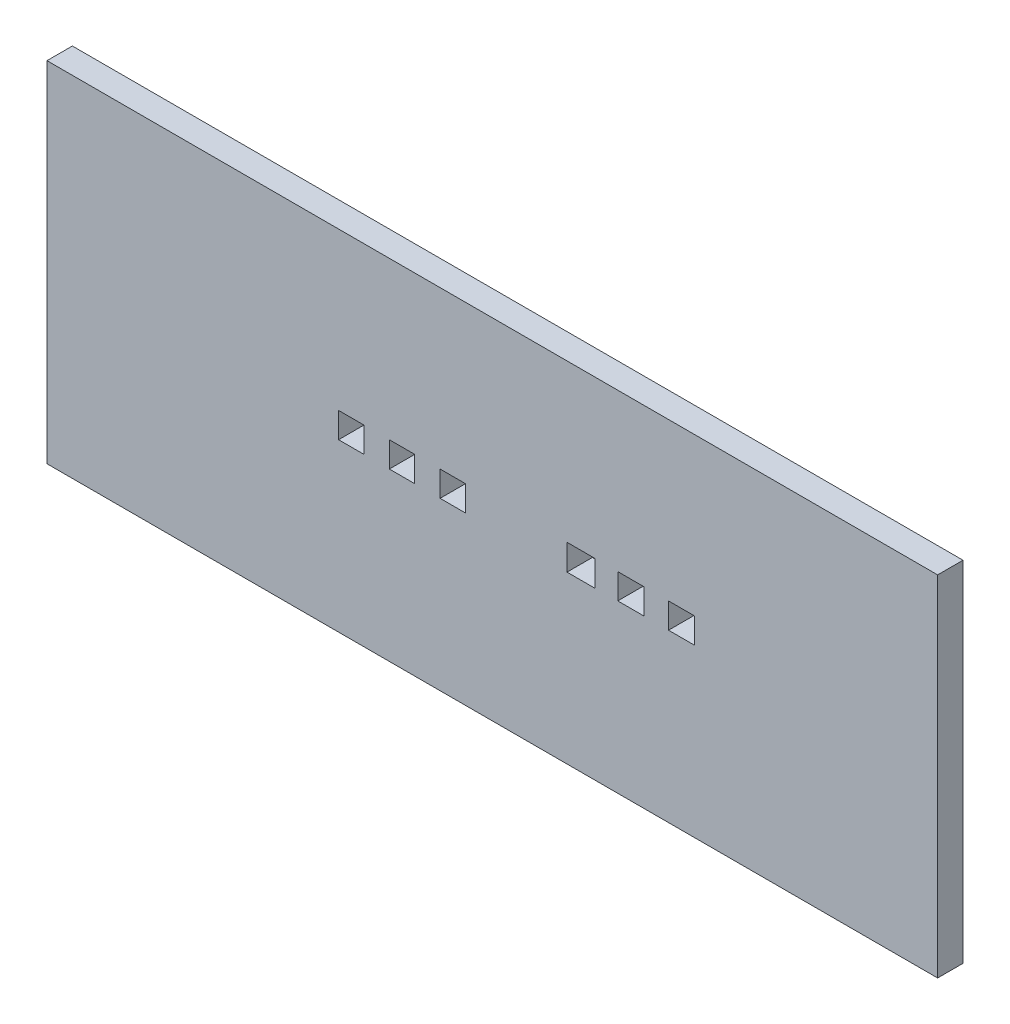
ISO-10303-21;
HEADER;
FILE_DESCRIPTION(('STEP AP214'),'2;1');
FILE_NAME('part.step','',(''),(''),'','','');
FILE_SCHEMA(('AUTOMOTIVE_DESIGN { 1 0 10303 214 1 1 1 1 }'));
ENDSEC;
DATA;
#1=APPLICATION_CONTEXT('core data for automotive mechanical design processes');
#2=APPLICATION_PROTOCOL_DEFINITION('international standard','automotive_design',2000,#1);
#3=PRODUCT_CONTEXT('',#1,'mechanical');
#4=PRODUCT('Part','Part','',(#3));
#5=PRODUCT_RELATED_PRODUCT_CATEGORY('part','',(#4));
#6=PRODUCT_DEFINITION_FORMATION('','',#4);
#7=PRODUCT_DEFINITION_CONTEXT('part definition',#1,'design');
#8=PRODUCT_DEFINITION('design','',#6,#7);
#9=PRODUCT_DEFINITION_SHAPE('','',#8);
#10=(LENGTH_UNIT() NAMED_UNIT(*) SI_UNIT(.MILLI.,.METRE.));
#11=(NAMED_UNIT(*) PLANE_ANGLE_UNIT() SI_UNIT($,.RADIAN.));
#12=(NAMED_UNIT(*) SI_UNIT($,.STERADIAN.) SOLID_ANGLE_UNIT());
#13=UNCERTAINTY_MEASURE_WITH_UNIT(LENGTH_MEASURE(1.E-05),#10,'distance_accuracy_value','');
#14=(GEOMETRIC_REPRESENTATION_CONTEXT(3) GLOBAL_UNCERTAINTY_ASSIGNED_CONTEXT((#13)) GLOBAL_UNIT_ASSIGNED_CONTEXT((#10,
#11,#12)) REPRESENTATION_CONTEXT('',''));
#15=CARTESIAN_POINT('',(0.,0.,0.));
#16=DIRECTION('',(0.,0.,1.));
#17=DIRECTION('',(1.,0.,0.));
#18=AXIS2_PLACEMENT_3D('',#15,#16,#17);
#19=CARTESIAN_POINT('',(0.,0.,6.35));
#20=DIRECTION('',(0.,0.,1.));
#21=DIRECTION('',(1.,0.,0.));
#22=AXIS2_PLACEMENT_3D('',#19,#20,#21);
#23=PLANE('',#22);
#24=DIRECTION('',(0.,1.,0.));
#25=VECTOR('',#24,1.);
#26=CARTESIAN_POINT('',(105.428458234982,-48.043151086541,6.35));
#27=LINE('',#26,#25);
#28=CARTESIAN_POINT('',(105.428458234982,-48.043151086541,6.35));
#29=VERTEX_POINT('',#28);
#30=CARTESIAN_POINT('',(105.428458234982,39.307273458256,6.35));
#31=VERTEX_POINT('',#30);
#32=EDGE_CURVE('E488',#29,#31,#27,.T.);
#33=ORIENTED_EDGE('',*,*,#32,.T.);
#34=DIRECTION('',(-1.,0.,0.));
#35=VECTOR('',#34,1.);
#36=CARTESIAN_POINT('',(105.428458234982,39.307273458256,6.35));
#37=LINE('',#36,#35);
#38=CARTESIAN_POINT('',(-117.410242609904,39.307273458256,6.35));
#39=VERTEX_POINT('',#38);
#40=EDGE_CURVE('E492',#31,#39,#37,.T.);
#41=ORIENTED_EDGE('',*,*,#40,.T.);
#42=DIRECTION('',(0.,-1.,0.));
#43=VECTOR('',#42,1.);
#44=CARTESIAN_POINT('',(-117.410242609904,-48.043151086541,6.35));
#45=LINE('',#44,#43);
#46=CARTESIAN_POINT('',(-117.410242609904,-48.043151086541,6.35));
#47=VERTEX_POINT('',#46);
#48=EDGE_CURVE('E496',#39,#47,#45,.T.);
#49=ORIENTED_EDGE('',*,*,#48,.T.);
#50=DIRECTION('',(1.,0.,0.));
#51=VECTOR('',#50,1.);
#52=CARTESIAN_POINT('',(105.428458234982,-48.043151086541,6.35));
#53=LINE('',#52,#51);
#54=EDGE_CURVE('E499',#47,#29,#53,.T.);
#55=ORIENTED_EDGE('',*,*,#54,.T.);
#56=EDGE_LOOP('',(#33,#41,#49,#55));
#57=FACE_BOUND('',#56,.T.);
#58=DIRECTION('',(1.,0.,0.));
#59=VECTOR('',#58,1.);
#60=CARTESIAN_POINT('',(-44.4500000238633,-6.35,6.35));
#61=LINE('',#60,#59);
#62=CARTESIAN_POINT('',(-44.4500000238633,-6.35,6.35));
#63=VERTEX_POINT('',#62);
#64=CARTESIAN_POINT('',(-38.1000000238634,-6.35,6.35));
#65=VERTEX_POINT('',#64);
#66=EDGE_CURVE('E448',#63,#65,#61,.T.);
#67=ORIENTED_EDGE('',*,*,#66,.F.);
#68=DIRECTION('',(0.,-1.,0.));
#69=VECTOR('',#68,1.);
#70=CARTESIAN_POINT('',(-44.4500000238633,0.,6.35));
#71=LINE('',#70,#69);
#72=CARTESIAN_POINT('',(-44.4500000238633,0.,6.35));
#73=VERTEX_POINT('',#72);
#74=EDGE_CURVE('E445',#73,#63,#71,.T.);
#75=ORIENTED_EDGE('',*,*,#74,.F.);
#76=DIRECTION('',(-1.,0.,0.));
#77=VECTOR('',#76,1.);
#78=CARTESIAN_POINT('',(-44.4500000238633,0.,6.35));
#79=LINE('',#78,#77);
#80=CARTESIAN_POINT('',(-38.1000000238634,0.,6.35));
#81=VERTEX_POINT('',#80);
#82=EDGE_CURVE('E456',#81,#73,#79,.T.);
#83=ORIENTED_EDGE('',*,*,#82,.F.);
#84=DIRECTION('',(0.,1.,0.));
#85=VECTOR('',#84,1.);
#86=CARTESIAN_POINT('',(-38.1000000238634,0.,6.35));
#87=LINE('',#86,#85);
#88=EDGE_CURVE('E452',#65,#81,#87,.T.);
#89=ORIENTED_EDGE('',*,*,#88,.F.);
#90=EDGE_LOOP('',(#67,#75,#83,#89));
#91=FACE_BOUND('',#90,.T.);
#92=DIRECTION('',(1.,0.,0.));
#93=VECTOR('',#92,1.);
#94=CARTESIAN_POINT('',(-31.7500000238633,-6.35,6.35));
#95=LINE('',#94,#93);
#96=CARTESIAN_POINT('',(-31.7500000238633,-6.35,6.35));
#97=VERTEX_POINT('',#96);
#98=CARTESIAN_POINT('',(-25.4000000238634,-6.35,6.35));
#99=VERTEX_POINT('',#98);
#100=EDGE_CURVE('E405',#97,#99,#95,.T.);
#101=ORIENTED_EDGE('',*,*,#100,.F.);
#102=DIRECTION('',(0.,-1.,0.));
#103=VECTOR('',#102,1.);
#104=CARTESIAN_POINT('',(-31.7500000238633,0.,6.35));
#105=LINE('',#104,#103);
#106=CARTESIAN_POINT('',(-31.7500000238633,0.,6.35));
#107=VERTEX_POINT('',#106);
#108=EDGE_CURVE('E402',#107,#97,#105,.T.);
#109=ORIENTED_EDGE('',*,*,#108,.F.);
#110=DIRECTION('',(-1.,0.,0.));
#111=VECTOR('',#110,1.);
#112=CARTESIAN_POINT('',(-31.7500000238633,0.,6.35));
#113=LINE('',#112,#111);
#114=CARTESIAN_POINT('',(-25.4000000238634,0.,6.35));
#115=VERTEX_POINT('',#114);
#116=EDGE_CURVE('E413',#115,#107,#113,.T.);
#117=ORIENTED_EDGE('',*,*,#116,.F.);
#118=DIRECTION('',(0.,1.,0.));
#119=VECTOR('',#118,1.);
#120=CARTESIAN_POINT('',(-25.4000000238634,0.,6.35));
#121=LINE('',#120,#119);
#122=EDGE_CURVE('E409',#99,#115,#121,.T.);
#123=ORIENTED_EDGE('',*,*,#122,.F.);
#124=EDGE_LOOP('',(#101,#109,#117,#123));
#125=FACE_BOUND('',#124,.T.);
#126=DIRECTION('',(1.,0.,0.));
#127=VECTOR('',#126,1.);
#128=CARTESIAN_POINT('',(-19.0500000238633,-6.35,6.35));
#129=LINE('',#128,#127);
#130=CARTESIAN_POINT('',(-19.0500000238633,-6.35,6.35));
#131=VERTEX_POINT('',#130);
#132=CARTESIAN_POINT('',(-12.7000000238634,-6.35,6.35));
#133=VERTEX_POINT('',#132);
#134=EDGE_CURVE('E362',#131,#133,#129,.T.);
#135=ORIENTED_EDGE('',*,*,#134,.F.);
#136=DIRECTION('',(0.,-1.,0.));
#137=VECTOR('',#136,1.);
#138=CARTESIAN_POINT('',(-19.0500000238633,0.,6.35));
#139=LINE('',#138,#137);
#140=CARTESIAN_POINT('',(-19.0500000238633,0.,6.35));
#141=VERTEX_POINT('',#140);
#142=EDGE_CURVE('E359',#141,#131,#139,.T.);
#143=ORIENTED_EDGE('',*,*,#142,.F.);
#144=DIRECTION('',(-1.,0.,0.));
#145=VECTOR('',#144,1.);
#146=CARTESIAN_POINT('',(-19.0500000238633,0.,6.35));
#147=LINE('',#146,#145);
#148=CARTESIAN_POINT('',(-12.7000000238634,0.,6.35));
#149=VERTEX_POINT('',#148);
#150=EDGE_CURVE('E370',#149,#141,#147,.T.);
#151=ORIENTED_EDGE('',*,*,#150,.F.);
#152=DIRECTION('',(0.,1.,0.));
#153=VECTOR('',#152,1.);
#154=CARTESIAN_POINT('',(-12.7000000238634,0.,6.35));
#155=LINE('',#154,#153);
#156=EDGE_CURVE('E366',#133,#149,#155,.T.);
#157=ORIENTED_EDGE('',*,*,#156,.F.);
#158=EDGE_LOOP('',(#135,#143,#151,#157));
#159=FACE_BOUND('',#158,.T.);
#160=DIRECTION('',(1.,0.,0.));
#161=VECTOR('',#160,1.);
#162=CARTESIAN_POINT('',(12.6999999761367,-6.46424191836036,6.35));
#163=LINE('',#162,#161);
#164=CARTESIAN_POINT('',(12.6999999761367,-6.46424191836036,6.35));
#165=VERTEX_POINT('',#164);
#166=CARTESIAN_POINT('',(19.6520511666441,-6.46424191836036,6.35));
#167=VERTEX_POINT('',#166);
#168=EDGE_CURVE('E319',#165,#167,#163,.T.);
#169=ORIENTED_EDGE('',*,*,#168,.F.);
#170=DIRECTION('',(0.,-1.,0.));
#171=VECTOR('',#170,1.);
#172=CARTESIAN_POINT('',(12.6999999761367,0.,6.35));
#173=LINE('',#172,#171);
#174=CARTESIAN_POINT('',(12.6999999761367,0.,6.35));
#175=VERTEX_POINT('',#174);
#176=EDGE_CURVE('E316',#175,#165,#173,.T.);
#177=ORIENTED_EDGE('',*,*,#176,.F.);
#178=DIRECTION('',(-1.,0.,0.));
#179=VECTOR('',#178,1.);
#180=CARTESIAN_POINT('',(12.6999999761367,0.,6.35));
#181=LINE('',#180,#179);
#182=CARTESIAN_POINT('',(19.6520511666441,0.,6.35));
#183=VERTEX_POINT('',#182);
#184=EDGE_CURVE('E327',#183,#175,#181,.T.);
#185=ORIENTED_EDGE('',*,*,#184,.F.);
#186=DIRECTION('',(0.,1.,0.));
#187=VECTOR('',#186,1.);
#188=CARTESIAN_POINT('',(19.6520511666441,0.,6.35));
#189=LINE('',#188,#187);
#190=EDGE_CURVE('E323',#167,#183,#189,.T.);
#191=ORIENTED_EDGE('',*,*,#190,.F.);
#192=EDGE_LOOP('',(#169,#177,#185,#191));
#193=FACE_BOUND('',#192,.T.);
#194=DIRECTION('',(1.,0.,0.));
#195=VECTOR('',#194,1.);
#196=CARTESIAN_POINT('',(25.3999999761367,-6.35,6.35));
#197=LINE('',#196,#195);
#198=CARTESIAN_POINT('',(25.3999999761367,-6.35,6.35));
#199=VERTEX_POINT('',#198);
#200=CARTESIAN_POINT('',(31.9555274475404,-6.35,6.35));
#201=VERTEX_POINT('',#200);
#202=EDGE_CURVE('E276',#199,#201,#197,.T.);
#203=ORIENTED_EDGE('',*,*,#202,.F.);
#204=DIRECTION('',(0.,-1.,0.));
#205=VECTOR('',#204,1.);
#206=CARTESIAN_POINT('',(25.3999999761367,0.,6.35));
#207=LINE('',#206,#205);
#208=CARTESIAN_POINT('',(25.3999999761367,0.,6.35));
#209=VERTEX_POINT('',#208);
#210=EDGE_CURVE('E273',#209,#199,#207,.T.);
#211=ORIENTED_EDGE('',*,*,#210,.F.);
#212=DIRECTION('',(-1.,0.,0.));
#213=VECTOR('',#212,1.);
#214=CARTESIAN_POINT('',(25.3999999761367,0.,6.35));
#215=LINE('',#214,#213);
#216=CARTESIAN_POINT('',(31.9555274475404,0.,6.35));
#217=VERTEX_POINT('',#216);
#218=EDGE_CURVE('E284',#217,#209,#215,.T.);
#219=ORIENTED_EDGE('',*,*,#218,.F.);
#220=DIRECTION('',(0.,1.,0.));
#221=VECTOR('',#220,1.);
#222=CARTESIAN_POINT('',(31.9555274475404,0.,6.35));
#223=LINE('',#222,#221);
#224=EDGE_CURVE('E280',#201,#217,#223,.T.);
#225=ORIENTED_EDGE('',*,*,#224,.F.);
#226=EDGE_LOOP('',(#203,#211,#219,#225));
#227=FACE_BOUND('',#226,.T.);
#228=DIRECTION('',(1.,0.,0.));
#229=VECTOR('',#228,1.);
#230=CARTESIAN_POINT('',(38.0999999761367,-6.35,6.35));
#231=LINE('',#230,#229);
#232=CARTESIAN_POINT('',(38.0999999761367,-6.35,6.35));
#233=VERTEX_POINT('',#232);
#234=CARTESIAN_POINT('',(44.6555274475404,-6.35,6.35));
#235=VERTEX_POINT('',#234);
#236=EDGE_CURVE('E234',#233,#235,#231,.T.);
#237=ORIENTED_EDGE('',*,*,#236,.F.);
#238=DIRECTION('',(0.,-1.,0.));
#239=VECTOR('',#238,1.);
#240=CARTESIAN_POINT('',(38.0999999761367,0.,6.35));
#241=LINE('',#240,#239);
#242=CARTESIAN_POINT('',(38.0999999761367,0.,6.35));
#243=VERTEX_POINT('',#242);
#244=EDGE_CURVE('E225',#243,#233,#241,.T.);
#245=ORIENTED_EDGE('',*,*,#244,.F.);
#246=DIRECTION('',(-1.,0.,0.));
#247=VECTOR('',#246,1.);
#248=CARTESIAN_POINT('',(38.0999999761367,0.,6.35));
#249=LINE('',#248,#247);
#250=CARTESIAN_POINT('',(44.6555274475404,0.,6.35));
#251=VERTEX_POINT('',#250);
#252=EDGE_CURVE('E251',#251,#243,#249,.T.);
#253=ORIENTED_EDGE('',*,*,#252,.F.);
#254=DIRECTION('',(0.,1.,0.));
#255=VECTOR('',#254,1.);
#256=CARTESIAN_POINT('',(44.6555274475404,0.,6.35));
#257=LINE('',#256,#255);
#258=EDGE_CURVE('E247',#235,#251,#257,.T.);
#259=ORIENTED_EDGE('',*,*,#258,.F.);
#260=EDGE_LOOP('',(#237,#245,#253,#259));
#261=FACE_BOUND('',#260,.T.);
#262=ADVANCED_FACE('F39',(#57,#91,#125,#159,#193,#227,#261),#23,.T.);
#263=CARTESIAN_POINT('',(0.,0.,0.));
#264=DIRECTION('',(0.,0.,1.));
#265=DIRECTION('',(1.,0.,0.));
#266=AXIS2_PLACEMENT_3D('',#263,#264,#265);
#267=PLANE('',#266);
#268=DIRECTION('',(0.,-1.,0.));
#269=VECTOR('',#268,1.);
#270=CARTESIAN_POINT('',(25.3999999761367,0.,0.));
#271=LINE('',#270,#269);
#272=CARTESIAN_POINT('',(25.3999999761367,0.,0.));
#273=VERTEX_POINT('',#272);
#274=CARTESIAN_POINT('',(25.3999999761367,-6.35,0.));
#275=VERTEX_POINT('',#274);
#276=EDGE_CURVE('E243',#273,#275,#271,.T.);
#277=ORIENTED_EDGE('',*,*,#276,.T.);
#278=DIRECTION('',(1.,0.,0.));
#279=VECTOR('',#278,1.);
#280=CARTESIAN_POINT('',(25.3999999761367,-6.35,0.));
#281=LINE('',#280,#279);
#282=CARTESIAN_POINT('',(31.9555274475404,-6.35,0.));
#283=VERTEX_POINT('',#282);
#284=EDGE_CURVE('E291',#275,#283,#281,.T.);
#285=ORIENTED_EDGE('',*,*,#284,.T.);
#286=DIRECTION('',(0.,1.,0.));
#287=VECTOR('',#286,1.);
#288=CARTESIAN_POINT('',(31.9555274475404,0.,0.));
#289=LINE('',#288,#287);
#290=CARTESIAN_POINT('',(31.9555274475404,0.,0.));
#291=VERTEX_POINT('',#290);
#292=EDGE_CURVE('E295',#283,#291,#289,.T.);
#293=ORIENTED_EDGE('',*,*,#292,.T.);
#294=DIRECTION('',(-1.,0.,0.));
#295=VECTOR('',#294,1.);
#296=CARTESIAN_POINT('',(25.3999999761367,0.,0.));
#297=LINE('',#296,#295);
#298=EDGE_CURVE('E277',#291,#273,#297,.T.);
#299=ORIENTED_EDGE('',*,*,#298,.T.);
#300=EDGE_LOOP('',(#277,#285,#293,#299));
#301=FACE_BOUND('',#300,.T.);
#302=DIRECTION('',(0.,-1.,0.));
#303=VECTOR('',#302,1.);
#304=CARTESIAN_POINT('',(-19.0500000238633,0.,0.));
#305=LINE('',#304,#303);
#306=CARTESIAN_POINT('',(-19.0500000238633,0.,0.));
#307=VERTEX_POINT('',#306);
#308=CARTESIAN_POINT('',(-19.0500000238633,-6.35,0.));
#309=VERTEX_POINT('',#308);
#310=EDGE_CURVE('E358',#307,#309,#305,.T.);
#311=ORIENTED_EDGE('',*,*,#310,.T.);
#312=DIRECTION('',(1.,0.,0.));
#313=VECTOR('',#312,1.);
#314=CARTESIAN_POINT('',(-19.0500000238633,-6.35,0.));
#315=LINE('',#314,#313);
#316=CARTESIAN_POINT('',(-12.7000000238634,-6.35,0.));
#317=VERTEX_POINT('',#316);
#318=EDGE_CURVE('E377',#309,#317,#315,.T.);
#319=ORIENTED_EDGE('',*,*,#318,.T.);
#320=DIRECTION('',(0.,1.,0.));
#321=VECTOR('',#320,1.);
#322=CARTESIAN_POINT('',(-12.7000000238634,0.,0.));
#323=LINE('',#322,#321);
#324=CARTESIAN_POINT('',(-12.7000000238634,0.,0.));
#325=VERTEX_POINT('',#324);
#326=EDGE_CURVE('E381',#317,#325,#323,.T.);
#327=ORIENTED_EDGE('',*,*,#326,.T.);
#328=DIRECTION('',(-1.,0.,0.));
#329=VECTOR('',#328,1.);
#330=CARTESIAN_POINT('',(-19.0500000238633,0.,0.));
#331=LINE('',#330,#329);
#332=EDGE_CURVE('E363',#325,#307,#331,.T.);
#333=ORIENTED_EDGE('',*,*,#332,.T.);
#334=EDGE_LOOP('',(#311,#319,#327,#333));
#335=FACE_BOUND('',#334,.T.);
#336=DIRECTION('',(0.,-1.,0.));
#337=VECTOR('',#336,1.);
#338=CARTESIAN_POINT('',(-44.4500000238633,0.,0.));
#339=LINE('',#338,#337);
#340=CARTESIAN_POINT('',(-44.4500000238633,0.,0.));
#341=VERTEX_POINT('',#340);
#342=CARTESIAN_POINT('',(-44.4500000238633,-6.35,0.));
#343=VERTEX_POINT('',#342);
#344=EDGE_CURVE('E444',#341,#343,#339,.T.);
#345=ORIENTED_EDGE('',*,*,#344,.T.);
#346=DIRECTION('',(1.,0.,0.));
#347=VECTOR('',#346,1.);
#348=CARTESIAN_POINT('',(-44.4500000238633,-6.35,0.));
#349=LINE('',#348,#347);
#350=CARTESIAN_POINT('',(-38.1000000238634,-6.35,0.));
#351=VERTEX_POINT('',#350);
#352=EDGE_CURVE('E463',#343,#351,#349,.T.);
#353=ORIENTED_EDGE('',*,*,#352,.T.);
#354=DIRECTION('',(0.,1.,0.));
#355=VECTOR('',#354,1.);
#356=CARTESIAN_POINT('',(-38.1000000238634,0.,0.));
#357=LINE('',#356,#355);
#358=CARTESIAN_POINT('',(-38.1000000238634,0.,0.));
#359=VERTEX_POINT('',#358);
#360=EDGE_CURVE('E467',#351,#359,#357,.T.);
#361=ORIENTED_EDGE('',*,*,#360,.T.);
#362=DIRECTION('',(-1.,0.,0.));
#363=VECTOR('',#362,1.);
#364=CARTESIAN_POINT('',(-44.4500000238633,0.,0.));
#365=LINE('',#364,#363);
#366=EDGE_CURVE('E449',#359,#341,#365,.T.);
#367=ORIENTED_EDGE('',*,*,#366,.T.);
#368=EDGE_LOOP('',(#345,#353,#361,#367));
#369=FACE_BOUND('',#368,.T.);
#370=DIRECTION('',(0.,1.,0.));
#371=VECTOR('',#370,1.);
#372=CARTESIAN_POINT('',(105.428458234982,-48.043151086541,0.));
#373=LINE('',#372,#371);
#374=CARTESIAN_POINT('',(105.428458234982,-48.043151086541,0.));
#375=VERTEX_POINT('',#374);
#376=CARTESIAN_POINT('',(105.428458234982,39.307273458256,0.));
#377=VERTEX_POINT('',#376);
#378=EDGE_CURVE('E487',#375,#377,#373,.T.);
#379=ORIENTED_EDGE('',*,*,#378,.F.);
#380=DIRECTION('',(1.,0.,0.));
#381=VECTOR('',#380,1.);
#382=CARTESIAN_POINT('',(105.428458234982,-48.043151086541,0.));
#383=LINE('',#382,#381);
#384=CARTESIAN_POINT('',(-117.410242609904,-48.043151086541,0.));
#385=VERTEX_POINT('',#384);
#386=EDGE_CURVE('E493',#385,#375,#383,.T.);
#387=ORIENTED_EDGE('',*,*,#386,.F.);
#388=DIRECTION('',(0.,-1.,0.));
#389=VECTOR('',#388,1.);
#390=CARTESIAN_POINT('',(-117.410242609904,-48.043151086541,0.));
#391=LINE('',#390,#389);
#392=CARTESIAN_POINT('',(-117.410242609904,39.307273458256,0.));
#393=VERTEX_POINT('',#392);
#394=EDGE_CURVE('E509',#393,#385,#391,.T.);
#395=ORIENTED_EDGE('',*,*,#394,.F.);
#396=DIRECTION('',(-1.,0.,0.));
#397=VECTOR('',#396,1.);
#398=CARTESIAN_POINT('',(105.428458234982,39.307273458256,0.));
#399=LINE('',#398,#397);
#400=EDGE_CURVE('E506',#377,#393,#399,.T.);
#401=ORIENTED_EDGE('',*,*,#400,.F.);
#402=EDGE_LOOP('',(#379,#387,#395,#401));
#403=FACE_BOUND('',#402,.T.);
#404=DIRECTION('',(0.,-1.,0.));
#405=VECTOR('',#404,1.);
#406=CARTESIAN_POINT('',(-31.7500000238633,0.,0.));
#407=LINE('',#406,#405);
#408=CARTESIAN_POINT('',(-31.7500000238633,0.,0.));
#409=VERTEX_POINT('',#408);
#410=CARTESIAN_POINT('',(-31.7500000238633,-6.35,0.));
#411=VERTEX_POINT('',#410);
#412=EDGE_CURVE('E401',#409,#411,#407,.T.);
#413=ORIENTED_EDGE('',*,*,#412,.T.);
#414=DIRECTION('',(1.,0.,0.));
#415=VECTOR('',#414,1.);
#416=CARTESIAN_POINT('',(-31.7500000238633,-6.35,0.));
#417=LINE('',#416,#415);
#418=CARTESIAN_POINT('',(-25.4000000238634,-6.35,0.));
#419=VERTEX_POINT('',#418);
#420=EDGE_CURVE('E420',#411,#419,#417,.T.);
#421=ORIENTED_EDGE('',*,*,#420,.T.);
#422=DIRECTION('',(0.,1.,0.));
#423=VECTOR('',#422,1.);
#424=CARTESIAN_POINT('',(-25.4000000238634,0.,0.));
#425=LINE('',#424,#423);
#426=CARTESIAN_POINT('',(-25.4000000238634,0.,0.));
#427=VERTEX_POINT('',#426);
#428=EDGE_CURVE('E424',#419,#427,#425,.T.);
#429=ORIENTED_EDGE('',*,*,#428,.T.);
#430=DIRECTION('',(-1.,0.,0.));
#431=VECTOR('',#430,1.);
#432=CARTESIAN_POINT('',(-31.7500000238633,0.,0.));
#433=LINE('',#432,#431);
#434=EDGE_CURVE('E406',#427,#409,#433,.T.);
#435=ORIENTED_EDGE('',*,*,#434,.T.);
#436=EDGE_LOOP('',(#413,#421,#429,#435));
#437=FACE_BOUND('',#436,.T.);
#438=DIRECTION('',(0.,-1.,0.));
#439=VECTOR('',#438,1.);
#440=CARTESIAN_POINT('',(12.6999999761367,0.,0.));
#441=LINE('',#440,#439);
#442=CARTESIAN_POINT('',(12.6999999761367,0.,0.));
#443=VERTEX_POINT('',#442);
#444=CARTESIAN_POINT('',(12.6999999761367,-6.46424191836036,0.));
#445=VERTEX_POINT('',#444);
#446=EDGE_CURVE('E315',#443,#445,#441,.T.);
#447=ORIENTED_EDGE('',*,*,#446,.T.);
#448=DIRECTION('',(1.,0.,0.));
#449=VECTOR('',#448,1.);
#450=CARTESIAN_POINT('',(12.6999999761367,-6.46424191836036,0.));
#451=LINE('',#450,#449);
#452=CARTESIAN_POINT('',(19.6520511666441,-6.46424191836036,0.));
#453=VERTEX_POINT('',#452);
#454=EDGE_CURVE('E334',#445,#453,#451,.T.);
#455=ORIENTED_EDGE('',*,*,#454,.T.);
#456=DIRECTION('',(0.,1.,0.));
#457=VECTOR('',#456,1.);
#458=CARTESIAN_POINT('',(19.6520511666441,0.,0.));
#459=LINE('',#458,#457);
#460=CARTESIAN_POINT('',(19.6520511666441,0.,0.));
#461=VERTEX_POINT('',#460);
#462=EDGE_CURVE('E338',#453,#461,#459,.T.);
#463=ORIENTED_EDGE('',*,*,#462,.T.);
#464=DIRECTION('',(-1.,0.,0.));
#465=VECTOR('',#464,1.);
#466=CARTESIAN_POINT('',(12.6999999761367,0.,0.));
#467=LINE('',#466,#465);
#468=EDGE_CURVE('E320',#461,#443,#467,.T.);
#469=ORIENTED_EDGE('',*,*,#468,.T.);
#470=EDGE_LOOP('',(#447,#455,#463,#469));
#471=FACE_BOUND('',#470,.T.);
#472=DIRECTION('',(0.,-1.,0.));
#473=VECTOR('',#472,1.);
#474=CARTESIAN_POINT('',(38.0999999761367,0.,0.));
#475=LINE('',#474,#473);
#476=CARTESIAN_POINT('',(38.0999999761367,0.,0.));
#477=VERTEX_POINT('',#476);
#478=CARTESIAN_POINT('',(38.0999999761367,-6.35,0.));
#479=VERTEX_POINT('',#478);
#480=EDGE_CURVE('E63',#477,#479,#475,.T.);
#481=ORIENTED_EDGE('',*,*,#480,.T.);
#482=DIRECTION('',(1.,0.,0.));
#483=VECTOR('',#482,1.);
#484=CARTESIAN_POINT('',(38.0999999761367,-6.35,0.));
#485=LINE('',#484,#483);
#486=CARTESIAN_POINT('',(44.6555274475404,-6.35,0.));
#487=VERTEX_POINT('',#486);
#488=EDGE_CURVE('E241',#479,#487,#485,.T.);
#489=ORIENTED_EDGE('',*,*,#488,.T.);
#490=DIRECTION('',(0.,1.,0.));
#491=VECTOR('',#490,1.);
#492=CARTESIAN_POINT('',(44.6555274475404,0.,0.));
#493=LINE('',#492,#491);
#494=CARTESIAN_POINT('',(44.6555274475404,0.,0.));
#495=VERTEX_POINT('',#494);
#496=EDGE_CURVE('E260',#487,#495,#493,.T.);
#497=ORIENTED_EDGE('',*,*,#496,.T.);
#498=DIRECTION('',(-1.,0.,0.));
#499=VECTOR('',#498,1.);
#500=CARTESIAN_POINT('',(38.0999999761367,0.,0.));
#501=LINE('',#500,#499);
#502=EDGE_CURVE('E235',#495,#477,#501,.T.);
#503=ORIENTED_EDGE('',*,*,#502,.T.);
#504=EDGE_LOOP('',(#481,#489,#497,#503));
#505=FACE_BOUND('',#504,.T.);
#506=ADVANCED_FACE('F532',(#301,#335,#369,#403,#437,#471,#505),#267,.F.);
#507=CARTESIAN_POINT('',(105.428458234982,-48.043151086541,6.35));
#508=DIRECTION('',(-1.,0.,0.));
#509=DIRECTION('',(0.,0.,1.));
#510=AXIS2_PLACEMENT_3D('',#507,#508,#509);
#511=PLANE('',#510);
#512=ORIENTED_EDGE('',*,*,#378,.T.);
#513=DIRECTION('',(0.,0.,-1.));
#514=VECTOR('',#513,1.);
#515=CARTESIAN_POINT('',(105.428458234982,39.307273458256,6.35));
#516=LINE('',#515,#514);
#517=EDGE_CURVE('E11',#31,#377,#516,.T.);
#518=ORIENTED_EDGE('',*,*,#517,.F.);
#519=ORIENTED_EDGE('',*,*,#32,.F.);
#520=DIRECTION('',(0.,0.,-1.));
#521=VECTOR('',#520,1.);
#522=CARTESIAN_POINT('',(105.428458234982,-48.043151086541,6.35));
#523=LINE('',#522,#521);
#524=EDGE_CURVE('E502',#29,#375,#523,.T.);
#525=ORIENTED_EDGE('',*,*,#524,.T.);
#526=EDGE_LOOP('',(#512,#518,#519,#525));
#527=FACE_BOUND('',#526,.T.);
#528=ADVANCED_FACE('F41',(#527),#511,.F.);
#529=CARTESIAN_POINT('',(105.428458234982,39.307273458256,6.35));
#530=DIRECTION('',(0.,-1.,0.));
#531=DIRECTION('',(0.,0.,-1.));
#532=AXIS2_PLACEMENT_3D('',#529,#530,#531);
#533=PLANE('',#532);
#534=ORIENTED_EDGE('',*,*,#400,.T.);
#535=DIRECTION('',(0.,0.,-1.));
#536=VECTOR('',#535,1.);
#537=CARTESIAN_POINT('',(-117.410242609904,39.307273458256,6.35));
#538=LINE('',#537,#536);
#539=EDGE_CURVE('E48',#39,#393,#538,.T.);
#540=ORIENTED_EDGE('',*,*,#539,.F.);
#541=ORIENTED_EDGE('',*,*,#40,.F.);
#542=ORIENTED_EDGE('',*,*,#517,.T.);
#543=EDGE_LOOP('',(#534,#540,#541,#542));
#544=FACE_BOUND('',#543,.T.);
#545=ADVANCED_FACE('F543',(#544),#533,.F.);
#546=CARTESIAN_POINT('',(-117.410242609904,-48.043151086541,6.35));
#547=DIRECTION('',(1.,0.,0.));
#548=DIRECTION('',(0.,0.,-1.));
#549=AXIS2_PLACEMENT_3D('',#546,#547,#548);
#550=PLANE('',#549);
#551=ORIENTED_EDGE('',*,*,#394,.T.);
#552=DIRECTION('',(0.,0.,-1.));
#553=VECTOR('',#552,1.);
#554=CARTESIAN_POINT('',(-117.410242609904,-48.043151086541,6.35));
#555=LINE('',#554,#553);
#556=EDGE_CURVE('E517',#47,#385,#555,.T.);
#557=ORIENTED_EDGE('',*,*,#556,.F.);
#558=ORIENTED_EDGE('',*,*,#48,.F.);
#559=ORIENTED_EDGE('',*,*,#539,.T.);
#560=EDGE_LOOP('',(#551,#557,#558,#559));
#561=FACE_BOUND('',#560,.T.);
#562=ADVANCED_FACE('F526',(#561),#550,.F.);
#563=CARTESIAN_POINT('',(105.428458234982,-48.043151086541,6.35));
#564=DIRECTION('',(0.,1.,0.));
#565=DIRECTION('',(0.,0.,1.));
#566=AXIS2_PLACEMENT_3D('',#563,#564,#565);
#567=PLANE('',#566);
#568=ORIENTED_EDGE('',*,*,#386,.T.);
#569=ORIENTED_EDGE('',*,*,#524,.F.);
#570=ORIENTED_EDGE('',*,*,#54,.F.);
#571=ORIENTED_EDGE('',*,*,#556,.T.);
#572=EDGE_LOOP('',(#568,#569,#570,#571));
#573=FACE_BOUND('',#572,.T.);
#574=ADVANCED_FACE('F536',(#573),#567,.F.);
#575=CARTESIAN_POINT('',(-44.4500000238633,0.,6.35));
#576=DIRECTION('',(1.,0.,0.));
#577=DIRECTION('',(0.,0.,-1.));
#578=AXIS2_PLACEMENT_3D('',#575,#576,#577);
#579=PLANE('',#578);
#580=ORIENTED_EDGE('',*,*,#344,.F.);
#581=DIRECTION('',(0.,0.,-1.));
#582=VECTOR('',#581,1.);
#583=CARTESIAN_POINT('',(-44.4500000238633,0.,6.35));
#584=LINE('',#583,#582);
#585=EDGE_CURVE('E459',#73,#341,#584,.T.);
#586=ORIENTED_EDGE('',*,*,#585,.F.);
#587=ORIENTED_EDGE('',*,*,#74,.T.);
#588=DIRECTION('',(0.,0.,-1.));
#589=VECTOR('',#588,1.);
#590=CARTESIAN_POINT('',(-44.4500000238633,-6.35,6.35));
#591=LINE('',#590,#589);
#592=EDGE_CURVE('E483',#63,#343,#591,.T.);
#593=ORIENTED_EDGE('',*,*,#592,.T.);
#594=EDGE_LOOP('',(#580,#586,#587,#593));
#595=FACE_BOUND('',#594,.T.);
#596=ADVANCED_FACE('F558',(#595),#579,.T.);
#597=CARTESIAN_POINT('',(-44.4500000238633,-6.35,6.35));
#598=DIRECTION('',(0.,1.,0.));
#599=DIRECTION('',(0.,0.,1.));
#600=AXIS2_PLACEMENT_3D('',#597,#598,#599);
#601=PLANE('',#600);
#602=ORIENTED_EDGE('',*,*,#352,.F.);
#603=ORIENTED_EDGE('',*,*,#592,.F.);
#604=ORIENTED_EDGE('',*,*,#66,.T.);
#605=DIRECTION('',(0.,0.,-1.));
#606=VECTOR('',#605,1.);
#607=CARTESIAN_POINT('',(-38.1000000238634,-6.35,6.35));
#608=LINE('',#607,#606);
#609=EDGE_CURVE('E480',#65,#351,#608,.T.);
#610=ORIENTED_EDGE('',*,*,#609,.T.);
#611=EDGE_LOOP('',(#602,#603,#604,#610));
#612=FACE_BOUND('',#611,.T.);
#613=ADVANCED_FACE('F565',(#612),#601,.T.);
#614=CARTESIAN_POINT('',(-38.1000000238634,0.,6.35));
#615=DIRECTION('',(-1.,0.,0.));
#616=DIRECTION('',(0.,0.,1.));
#617=AXIS2_PLACEMENT_3D('',#614,#615,#616);
#618=PLANE('',#617);
#619=ORIENTED_EDGE('',*,*,#360,.F.);
#620=ORIENTED_EDGE('',*,*,#609,.F.);
#621=ORIENTED_EDGE('',*,*,#88,.T.);
#622=DIRECTION('',(0.,0.,-1.));
#623=VECTOR('',#622,1.);
#624=CARTESIAN_POINT('',(-38.1000000238634,0.,6.35));
#625=LINE('',#624,#623);
#626=EDGE_CURVE('E477',#81,#359,#625,.T.);
#627=ORIENTED_EDGE('',*,*,#626,.T.);
#628=EDGE_LOOP('',(#619,#620,#621,#627));
#629=FACE_BOUND('',#628,.T.);
#630=ADVANCED_FACE('F570',(#629),#618,.T.);
#631=CARTESIAN_POINT('',(-44.4500000238633,0.,6.35));
#632=DIRECTION('',(0.,-1.,0.));
#633=DIRECTION('',(0.,0.,-1.));
#634=AXIS2_PLACEMENT_3D('',#631,#632,#633);
#635=PLANE('',#634);
#636=ORIENTED_EDGE('',*,*,#366,.F.);
#637=ORIENTED_EDGE('',*,*,#626,.F.);
#638=ORIENTED_EDGE('',*,*,#82,.T.);
#639=ORIENTED_EDGE('',*,*,#585,.T.);
#640=EDGE_LOOP('',(#636,#637,#638,#639));
#641=FACE_BOUND('',#640,.T.);
#642=ADVANCED_FACE('F578',(#641),#635,.T.);
#643=CARTESIAN_POINT('',(-31.7500000238633,0.,6.35));
#644=DIRECTION('',(1.,0.,0.));
#645=DIRECTION('',(0.,0.,-1.));
#646=AXIS2_PLACEMENT_3D('',#643,#644,#645);
#647=PLANE('',#646);
#648=ORIENTED_EDGE('',*,*,#412,.F.);
#649=DIRECTION('',(0.,0.,-1.));
#650=VECTOR('',#649,1.);
#651=CARTESIAN_POINT('',(-31.7500000238633,0.,6.35));
#652=LINE('',#651,#650);
#653=EDGE_CURVE('E416',#107,#409,#652,.T.);
#654=ORIENTED_EDGE('',*,*,#653,.F.);
#655=ORIENTED_EDGE('',*,*,#108,.T.);
#656=DIRECTION('',(0.,0.,-1.));
#657=VECTOR('',#656,1.);
#658=CARTESIAN_POINT('',(-31.7500000238633,-6.35,6.35));
#659=LINE('',#658,#657);
#660=EDGE_CURVE('E440',#97,#411,#659,.T.);
#661=ORIENTED_EDGE('',*,*,#660,.T.);
#662=EDGE_LOOP('',(#648,#654,#655,#661));
#663=FACE_BOUND('',#662,.T.);
#664=ADVANCED_FACE('F673',(#663),#647,.T.);
#665=CARTESIAN_POINT('',(-31.7500000238633,-6.35,6.35));
#666=DIRECTION('',(0.,1.,0.));
#667=DIRECTION('',(0.,0.,1.));
#668=AXIS2_PLACEMENT_3D('',#665,#666,#667);
#669=PLANE('',#668);
#670=ORIENTED_EDGE('',*,*,#420,.F.);
#671=ORIENTED_EDGE('',*,*,#660,.F.);
#672=ORIENTED_EDGE('',*,*,#100,.T.);
#673=DIRECTION('',(0.,0.,-1.));
#674=VECTOR('',#673,1.);
#675=CARTESIAN_POINT('',(-25.4000000238634,-6.35,6.35));
#676=LINE('',#675,#674);
#677=EDGE_CURVE('E437',#99,#419,#676,.T.);
#678=ORIENTED_EDGE('',*,*,#677,.T.);
#679=EDGE_LOOP('',(#670,#671,#672,#678));
#680=FACE_BOUND('',#679,.T.);
#681=ADVANCED_FACE('F669',(#680),#669,.T.);
#682=CARTESIAN_POINT('',(-25.4000000238634,0.,6.35));
#683=DIRECTION('',(-1.,0.,0.));
#684=DIRECTION('',(0.,0.,1.));
#685=AXIS2_PLACEMENT_3D('',#682,#683,#684);
#686=PLANE('',#685);
#687=ORIENTED_EDGE('',*,*,#428,.F.);
#688=ORIENTED_EDGE('',*,*,#677,.F.);
#689=ORIENTED_EDGE('',*,*,#122,.T.);
#690=DIRECTION('',(0.,0.,-1.));
#691=VECTOR('',#690,1.);
#692=CARTESIAN_POINT('',(-25.4000000238634,0.,6.35));
#693=LINE('',#692,#691);
#694=EDGE_CURVE('E434',#115,#427,#693,.T.);
#695=ORIENTED_EDGE('',*,*,#694,.T.);
#696=EDGE_LOOP('',(#687,#688,#689,#695));
#697=FACE_BOUND('',#696,.T.);
#698=ADVANCED_FACE('F665',(#697),#686,.T.);
#699=CARTESIAN_POINT('',(-31.7500000238633,0.,6.35));
#700=DIRECTION('',(0.,-1.,0.));
#701=DIRECTION('',(0.,0.,-1.));
#702=AXIS2_PLACEMENT_3D('',#699,#700,#701);
#703=PLANE('',#702);
#704=ORIENTED_EDGE('',*,*,#434,.F.);
#705=ORIENTED_EDGE('',*,*,#694,.F.);
#706=ORIENTED_EDGE('',*,*,#116,.T.);
#707=ORIENTED_EDGE('',*,*,#653,.T.);
#708=EDGE_LOOP('',(#704,#705,#706,#707));
#709=FACE_BOUND('',#708,.T.);
#710=ADVANCED_FACE('F661',(#709),#703,.T.);
#711=CARTESIAN_POINT('',(-19.0500000238633,0.,6.35));
#712=DIRECTION('',(1.,0.,0.));
#713=DIRECTION('',(0.,0.,-1.));
#714=AXIS2_PLACEMENT_3D('',#711,#712,#713);
#715=PLANE('',#714);
#716=ORIENTED_EDGE('',*,*,#310,.F.);
#717=DIRECTION('',(0.,0.,-1.));
#718=VECTOR('',#717,1.);
#719=CARTESIAN_POINT('',(-19.0500000238633,0.,6.35));
#720=LINE('',#719,#718);
#721=EDGE_CURVE('E373',#141,#307,#720,.T.);
#722=ORIENTED_EDGE('',*,*,#721,.F.);
#723=ORIENTED_EDGE('',*,*,#142,.T.);
#724=DIRECTION('',(0.,0.,-1.));
#725=VECTOR('',#724,1.);
#726=CARTESIAN_POINT('',(-19.0500000238633,-6.35,6.35));
#727=LINE('',#726,#725);
#728=EDGE_CURVE('E397',#131,#309,#727,.T.);
#729=ORIENTED_EDGE('',*,*,#728,.T.);
#730=EDGE_LOOP('',(#716,#722,#723,#729));
#731=FACE_BOUND('',#730,.T.);
#732=ADVANCED_FACE('F657',(#731),#715,.T.);
#733=CARTESIAN_POINT('',(-19.0500000238633,-6.35,6.35));
#734=DIRECTION('',(0.,1.,0.));
#735=DIRECTION('',(0.,0.,1.));
#736=AXIS2_PLACEMENT_3D('',#733,#734,#735);
#737=PLANE('',#736);
#738=ORIENTED_EDGE('',*,*,#318,.F.);
#739=ORIENTED_EDGE('',*,*,#728,.F.);
#740=ORIENTED_EDGE('',*,*,#134,.T.);
#741=DIRECTION('',(0.,0.,-1.));
#742=VECTOR('',#741,1.);
#743=CARTESIAN_POINT('',(-12.7000000238634,-6.35,6.35));
#744=LINE('',#743,#742);
#745=EDGE_CURVE('E394',#133,#317,#744,.T.);
#746=ORIENTED_EDGE('',*,*,#745,.T.);
#747=EDGE_LOOP('',(#738,#739,#740,#746));
#748=FACE_BOUND('',#747,.T.);
#749=ADVANCED_FACE('F653',(#748),#737,.T.);
#750=CARTESIAN_POINT('',(-12.7000000238634,0.,6.35));
#751=DIRECTION('',(-1.,0.,0.));
#752=DIRECTION('',(0.,0.,1.));
#753=AXIS2_PLACEMENT_3D('',#750,#751,#752);
#754=PLANE('',#753);
#755=ORIENTED_EDGE('',*,*,#326,.F.);
#756=ORIENTED_EDGE('',*,*,#745,.F.);
#757=ORIENTED_EDGE('',*,*,#156,.T.);
#758=DIRECTION('',(0.,0.,-1.));
#759=VECTOR('',#758,1.);
#760=CARTESIAN_POINT('',(-12.7000000238634,0.,6.35));
#761=LINE('',#760,#759);
#762=EDGE_CURVE('E391',#149,#325,#761,.T.);
#763=ORIENTED_EDGE('',*,*,#762,.T.);
#764=EDGE_LOOP('',(#755,#756,#757,#763));
#765=FACE_BOUND('',#764,.T.);
#766=ADVANCED_FACE('F649',(#765),#754,.T.);
#767=CARTESIAN_POINT('',(-19.0500000238633,0.,6.35));
#768=DIRECTION('',(0.,-1.,0.));
#769=DIRECTION('',(0.,0.,-1.));
#770=AXIS2_PLACEMENT_3D('',#767,#768,#769);
#771=PLANE('',#770);
#772=ORIENTED_EDGE('',*,*,#332,.F.);
#773=ORIENTED_EDGE('',*,*,#762,.F.);
#774=ORIENTED_EDGE('',*,*,#150,.T.);
#775=ORIENTED_EDGE('',*,*,#721,.T.);
#776=EDGE_LOOP('',(#772,#773,#774,#775));
#777=FACE_BOUND('',#776,.T.);
#778=ADVANCED_FACE('F645',(#777),#771,.T.);
#779=CARTESIAN_POINT('',(12.6999999761367,0.,6.35));
#780=DIRECTION('',(1.,0.,0.));
#781=DIRECTION('',(0.,0.,-1.));
#782=AXIS2_PLACEMENT_3D('',#779,#780,#781);
#783=PLANE('',#782);
#784=ORIENTED_EDGE('',*,*,#446,.F.);
#785=DIRECTION('',(0.,0.,-1.));
#786=VECTOR('',#785,1.);
#787=CARTESIAN_POINT('',(12.6999999761367,0.,6.35));
#788=LINE('',#787,#786);
#789=EDGE_CURVE('E330',#175,#443,#788,.T.);
#790=ORIENTED_EDGE('',*,*,#789,.F.);
#791=ORIENTED_EDGE('',*,*,#176,.T.);
#792=DIRECTION('',(0.,0.,-1.));
#793=VECTOR('',#792,1.);
#794=CARTESIAN_POINT('',(12.6999999761367,-6.46424191836036,6.35));
#795=LINE('',#794,#793);
#796=EDGE_CURVE('E354',#165,#445,#795,.T.);
#797=ORIENTED_EDGE('',*,*,#796,.T.);
#798=EDGE_LOOP('',(#784,#790,#791,#797));
#799=FACE_BOUND('',#798,.T.);
#800=ADVANCED_FACE('F641',(#799),#783,.T.);
#801=CARTESIAN_POINT('',(12.6999999761367,-6.46424191836036,6.35));
#802=DIRECTION('',(0.,1.,0.));
#803=DIRECTION('',(0.,0.,1.));
#804=AXIS2_PLACEMENT_3D('',#801,#802,#803);
#805=PLANE('',#804);
#806=ORIENTED_EDGE('',*,*,#454,.F.);
#807=ORIENTED_EDGE('',*,*,#796,.F.);
#808=ORIENTED_EDGE('',*,*,#168,.T.);
#809=DIRECTION('',(0.,0.,-1.));
#810=VECTOR('',#809,1.);
#811=CARTESIAN_POINT('',(19.6520511666441,-6.46424191836036,6.35));
#812=LINE('',#811,#810);
#813=EDGE_CURVE('E351',#167,#453,#812,.T.);
#814=ORIENTED_EDGE('',*,*,#813,.T.);
#815=EDGE_LOOP('',(#806,#807,#808,#814));
#816=FACE_BOUND('',#815,.T.);
#817=ADVANCED_FACE('F637',(#816),#805,.T.);
#818=CARTESIAN_POINT('',(19.6520511666441,0.,6.35));
#819=DIRECTION('',(-1.,0.,0.));
#820=DIRECTION('',(0.,0.,1.));
#821=AXIS2_PLACEMENT_3D('',#818,#819,#820);
#822=PLANE('',#821);
#823=ORIENTED_EDGE('',*,*,#462,.F.);
#824=ORIENTED_EDGE('',*,*,#813,.F.);
#825=ORIENTED_EDGE('',*,*,#190,.T.);
#826=DIRECTION('',(0.,0.,-1.));
#827=VECTOR('',#826,1.);
#828=CARTESIAN_POINT('',(19.6520511666441,0.,6.35));
#829=LINE('',#828,#827);
#830=EDGE_CURVE('E348',#183,#461,#829,.T.);
#831=ORIENTED_EDGE('',*,*,#830,.T.);
#832=EDGE_LOOP('',(#823,#824,#825,#831));
#833=FACE_BOUND('',#832,.T.);
#834=ADVANCED_FACE('F633',(#833),#822,.T.);
#835=CARTESIAN_POINT('',(12.6999999761367,0.,6.35));
#836=DIRECTION('',(0.,-1.,0.));
#837=DIRECTION('',(0.,0.,-1.));
#838=AXIS2_PLACEMENT_3D('',#835,#836,#837);
#839=PLANE('',#838);
#840=ORIENTED_EDGE('',*,*,#468,.F.);
#841=ORIENTED_EDGE('',*,*,#830,.F.);
#842=ORIENTED_EDGE('',*,*,#184,.T.);
#843=ORIENTED_EDGE('',*,*,#789,.T.);
#844=EDGE_LOOP('',(#840,#841,#842,#843));
#845=FACE_BOUND('',#844,.T.);
#846=ADVANCED_FACE('F630',(#845),#839,.T.);
#847=CARTESIAN_POINT('',(25.3999999761367,0.,6.35));
#848=DIRECTION('',(1.,0.,0.));
#849=DIRECTION('',(0.,0.,-1.));
#850=AXIS2_PLACEMENT_3D('',#847,#848,#849);
#851=PLANE('',#850);
#852=ORIENTED_EDGE('',*,*,#276,.F.);
#853=DIRECTION('',(0.,0.,-1.));
#854=VECTOR('',#853,1.);
#855=CARTESIAN_POINT('',(25.3999999761367,0.,6.35));
#856=LINE('',#855,#854);
#857=EDGE_CURVE('E287',#209,#273,#856,.T.);
#858=ORIENTED_EDGE('',*,*,#857,.F.);
#859=ORIENTED_EDGE('',*,*,#210,.T.);
#860=DIRECTION('',(0.,0.,-1.));
#861=VECTOR('',#860,1.);
#862=CARTESIAN_POINT('',(25.3999999761367,-6.35,6.35));
#863=LINE('',#862,#861);
#864=EDGE_CURVE('E311',#199,#275,#863,.T.);
#865=ORIENTED_EDGE('',*,*,#864,.T.);
#866=EDGE_LOOP('',(#852,#858,#859,#865));
#867=FACE_BOUND('',#866,.T.);
#868=ADVANCED_FACE('F612',(#867),#851,.T.);
#869=CARTESIAN_POINT('',(25.3999999761367,-6.35,6.35));
#870=DIRECTION('',(0.,1.,0.));
#871=DIRECTION('',(0.,0.,1.));
#872=AXIS2_PLACEMENT_3D('',#869,#870,#871);
#873=PLANE('',#872);
#874=ORIENTED_EDGE('',*,*,#284,.F.);
#875=ORIENTED_EDGE('',*,*,#864,.F.);
#876=ORIENTED_EDGE('',*,*,#202,.T.);
#877=DIRECTION('',(0.,0.,-1.));
#878=VECTOR('',#877,1.);
#879=CARTESIAN_POINT('',(31.9555274475404,-6.35,6.35));
#880=LINE('',#879,#878);
#881=EDGE_CURVE('E308',#201,#283,#880,.T.);
#882=ORIENTED_EDGE('',*,*,#881,.T.);
#883=EDGE_LOOP('',(#874,#875,#876,#882));
#884=FACE_BOUND('',#883,.T.);
#885=ADVANCED_FACE('F605',(#884),#873,.T.);
#886=CARTESIAN_POINT('',(31.9555274475404,0.,6.35));
#887=DIRECTION('',(-1.,0.,0.));
#888=DIRECTION('',(0.,0.,1.));
#889=AXIS2_PLACEMENT_3D('',#886,#887,#888);
#890=PLANE('',#889);
#891=ORIENTED_EDGE('',*,*,#292,.F.);
#892=ORIENTED_EDGE('',*,*,#881,.F.);
#893=ORIENTED_EDGE('',*,*,#224,.T.);
#894=DIRECTION('',(0.,0.,-1.));
#895=VECTOR('',#894,1.);
#896=CARTESIAN_POINT('',(31.9555274475404,0.,6.35));
#897=LINE('',#896,#895);
#898=EDGE_CURVE('E305',#217,#291,#897,.T.);
#899=ORIENTED_EDGE('',*,*,#898,.T.);
#900=EDGE_LOOP('',(#891,#892,#893,#899));
#901=FACE_BOUND('',#900,.T.);
#902=ADVANCED_FACE('F608',(#901),#890,.T.);
#903=CARTESIAN_POINT('',(25.3999999761367,0.,6.35));
#904=DIRECTION('',(0.,-1.,0.));
#905=DIRECTION('',(0.,0.,-1.));
#906=AXIS2_PLACEMENT_3D('',#903,#904,#905);
#907=PLANE('',#906);
#908=ORIENTED_EDGE('',*,*,#298,.F.);
#909=ORIENTED_EDGE('',*,*,#898,.F.);
#910=ORIENTED_EDGE('',*,*,#218,.T.);
#911=ORIENTED_EDGE('',*,*,#857,.T.);
#912=EDGE_LOOP('',(#908,#909,#910,#911));
#913=FACE_BOUND('',#912,.T.);
#914=ADVANCED_FACE('F615',(#913),#907,.T.);
#915=CARTESIAN_POINT('',(38.0999999761367,0.,6.35));
#916=DIRECTION('',(1.,0.,0.));
#917=DIRECTION('',(0.,0.,-1.));
#918=AXIS2_PLACEMENT_3D('',#915,#916,#917);
#919=PLANE('',#918);
#920=ORIENTED_EDGE('',*,*,#480,.F.);
#921=DIRECTION('',(0.,0.,-1.));
#922=VECTOR('',#921,1.);
#923=CARTESIAN_POINT('',(38.0999999761367,0.,6.35));
#924=LINE('',#923,#922);
#925=EDGE_CURVE('E229',#243,#477,#924,.T.);
#926=ORIENTED_EDGE('',*,*,#925,.F.);
#927=ORIENTED_EDGE('',*,*,#244,.T.);
#928=DIRECTION('',(0.,0.,-1.));
#929=VECTOR('',#928,1.);
#930=CARTESIAN_POINT('',(38.0999999761367,-6.35,6.35));
#931=LINE('',#930,#929);
#932=EDGE_CURVE('E228',#233,#479,#931,.T.);
#933=ORIENTED_EDGE('',*,*,#932,.T.);
#934=EDGE_LOOP('',(#920,#926,#927,#933));
#935=FACE_BOUND('',#934,.T.);
#936=ADVANCED_FACE('F227',(#935),#919,.T.);
#937=CARTESIAN_POINT('',(38.0999999761367,-6.35,6.35));
#938=DIRECTION('',(0.,1.,0.));
#939=DIRECTION('',(0.,0.,1.));
#940=AXIS2_PLACEMENT_3D('',#937,#938,#939);
#941=PLANE('',#940);
#942=ORIENTED_EDGE('',*,*,#488,.F.);
#943=ORIENTED_EDGE('',*,*,#932,.F.);
#944=ORIENTED_EDGE('',*,*,#236,.T.);
#945=DIRECTION('',(0.,0.,-1.));
#946=VECTOR('',#945,1.);
#947=CARTESIAN_POINT('',(44.6555274475404,-6.35,6.35));
#948=LINE('',#947,#946);
#949=EDGE_CURVE('E244',#235,#487,#948,.T.);
#950=ORIENTED_EDGE('',*,*,#949,.T.);
#951=EDGE_LOOP('',(#942,#943,#944,#950));
#952=FACE_BOUND('',#951,.T.);
#953=ADVANCED_FACE('F238',(#952),#941,.T.);
#954=CARTESIAN_POINT('',(44.6555274475404,0.,6.35));
#955=DIRECTION('',(-1.,0.,0.));
#956=DIRECTION('',(0.,0.,1.));
#957=AXIS2_PLACEMENT_3D('',#954,#955,#956);
#958=PLANE('',#957);
#959=ORIENTED_EDGE('',*,*,#496,.F.);
#960=ORIENTED_EDGE('',*,*,#949,.F.);
#961=ORIENTED_EDGE('',*,*,#258,.T.);
#962=DIRECTION('',(0.,0.,-1.));
#963=VECTOR('',#962,1.);
#964=CARTESIAN_POINT('',(44.6555274475404,0.,6.35));
#965=LINE('',#964,#963);
#966=EDGE_CURVE('E55',#251,#495,#965,.T.);
#967=ORIENTED_EDGE('',*,*,#966,.T.);
#968=EDGE_LOOP('',(#959,#960,#961,#967));
#969=FACE_BOUND('',#968,.T.);
#970=ADVANCED_FACE('F768',(#969),#958,.T.);
#971=CARTESIAN_POINT('',(38.0999999761367,0.,6.35));
#972=DIRECTION('',(0.,-1.,0.));
#973=DIRECTION('',(0.,0.,-1.));
#974=AXIS2_PLACEMENT_3D('',#971,#972,#973);
#975=PLANE('',#974);
#976=ORIENTED_EDGE('',*,*,#502,.F.);
#977=ORIENTED_EDGE('',*,*,#966,.F.);
#978=ORIENTED_EDGE('',*,*,#252,.T.);
#979=ORIENTED_EDGE('',*,*,#925,.T.);
#980=EDGE_LOOP('',(#976,#977,#978,#979));
#981=FACE_BOUND('',#980,.T.);
#982=ADVANCED_FACE('F776',(#981),#975,.T.);
#983=CLOSED_SHELL('',(#262,#506,#528,#545,#562,#574,#596,#613,#630,#642,#664,#681,#698,#710,
#732,#749,#766,#778,#800,#817,#834,#846,#868,#885,#902,#914,#936,#953,#970,#982));
#984=MANIFOLD_SOLID_BREP('B2',#983);
#985=ADVANCED_BREP_SHAPE_REPRESENTATION('',(#18,#984),#14);
#986=SHAPE_DEFINITION_REPRESENTATION(#9,#985);
ENDSEC;
END-ISO-10303-21;
